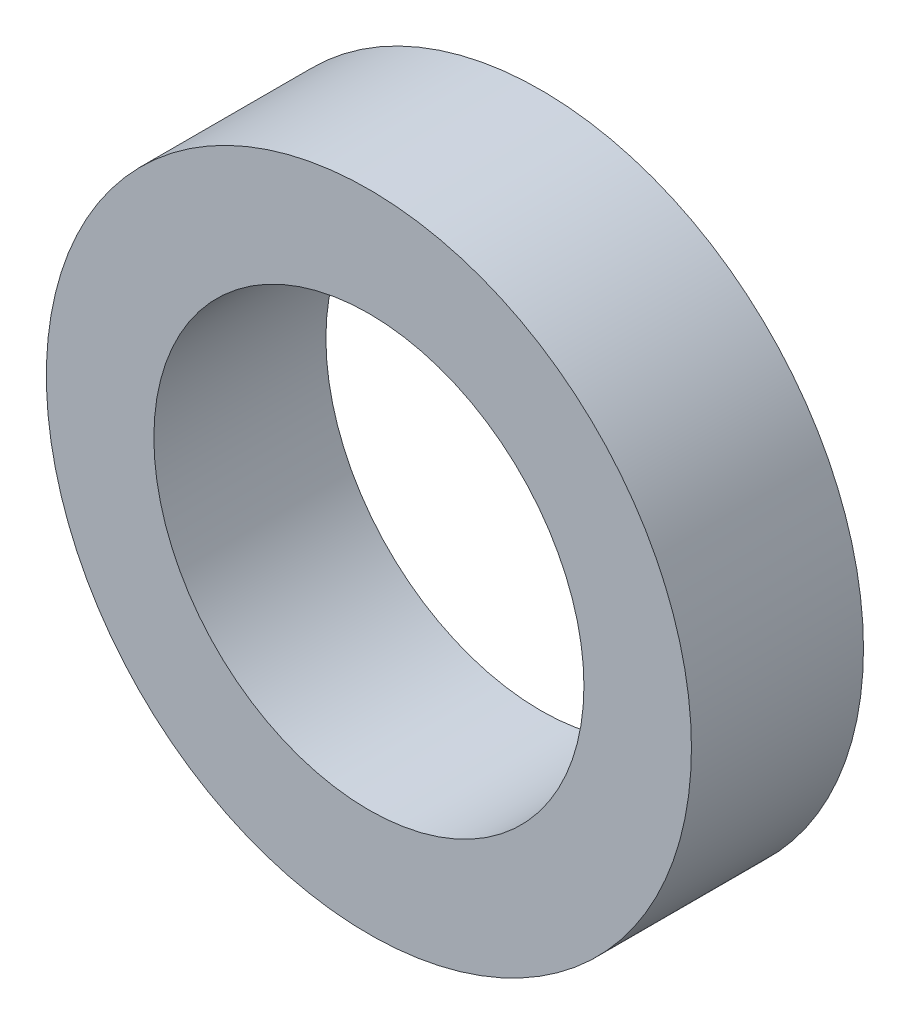
ISO-10303-21;
HEADER;
FILE_DESCRIPTION(('STEP AP214'),'2;1');
FILE_NAME('part.step','',(''),(''),'','','');
FILE_SCHEMA(('AUTOMOTIVE_DESIGN { 1 0 10303 214 1 1 1 1 }'));
ENDSEC;
DATA;
#1=APPLICATION_CONTEXT('core data for automotive mechanical design processes');
#2=APPLICATION_PROTOCOL_DEFINITION('international standard','automotive_design',2000,#1);
#3=PRODUCT_CONTEXT('',#1,'mechanical');
#4=PRODUCT('Part','Part','',(#3));
#5=PRODUCT_RELATED_PRODUCT_CATEGORY('part','',(#4));
#6=PRODUCT_DEFINITION_FORMATION('','',#4);
#7=PRODUCT_DEFINITION_CONTEXT('part definition',#1,'design');
#8=PRODUCT_DEFINITION('design','',#6,#7);
#9=PRODUCT_DEFINITION_SHAPE('','',#8);
#10=(LENGTH_UNIT() NAMED_UNIT(*) SI_UNIT(.MILLI.,.METRE.));
#11=(NAMED_UNIT(*) PLANE_ANGLE_UNIT() SI_UNIT($,.RADIAN.));
#12=(NAMED_UNIT(*) SI_UNIT($,.STERADIAN.) SOLID_ANGLE_UNIT());
#13=UNCERTAINTY_MEASURE_WITH_UNIT(LENGTH_MEASURE(1.E-05),#10,'distance_accuracy_value','');
#14=(GEOMETRIC_REPRESENTATION_CONTEXT(3) GLOBAL_UNCERTAINTY_ASSIGNED_CONTEXT((#13)) GLOBAL_UNIT_ASSIGNED_CONTEXT((#10,
#11,#12)) REPRESENTATION_CONTEXT('',''));
#15=CARTESIAN_POINT('',(0.,0.,0.));
#16=DIRECTION('',(0.,0.,1.));
#17=DIRECTION('',(1.,0.,0.));
#18=AXIS2_PLACEMENT_3D('',#15,#16,#17);
#19=CARTESIAN_POINT('',(0.,0.,2.));
#20=DIRECTION('',(0.,0.,1.));
#21=DIRECTION('',(1.,0.,0.));
#22=AXIS2_PLACEMENT_3D('',#19,#20,#21);
#23=PLANE('',#22);
#24=CARTESIAN_POINT('',(0.,0.,2.));
#25=DIRECTION('',(0.,0.,1.));
#26=DIRECTION('',(1.,0.,0.));
#27=AXIS2_PLACEMENT_3D('',#24,#25,#26);
#28=CIRCLE('',#27,7.5);
#29=CARTESIAN_POINT('',(7.5,0.,2.));
#30=VERTEX_POINT('',#29);
#31=EDGE_CURVE('E10',#30,#30,#28,.T.);
#32=ORIENTED_EDGE('',*,*,#31,.T.);
#33=EDGE_LOOP('',(#32));
#34=FACE_BOUND('',#33,.T.);
#35=CARTESIAN_POINT('',(0.,0.,2.));
#36=DIRECTION('',(0.,0.,1.));
#37=DIRECTION('',(1.,0.,0.));
#38=AXIS2_PLACEMENT_3D('',#35,#36,#37);
#39=CIRCLE('',#38,5.);
#40=CARTESIAN_POINT('',(5.,0.,2.));
#41=VERTEX_POINT('',#40);
#42=EDGE_CURVE('E46',#41,#41,#39,.T.);
#43=ORIENTED_EDGE('',*,*,#42,.F.);
#44=EDGE_LOOP('',(#43));
#45=FACE_BOUND('',#44,.T.);
#46=ADVANCED_FACE('F35',(#34,#45),#23,.T.);
#47=CARTESIAN_POINT('',(0.,0.,-2.));
#48=DIRECTION('',(0.,0.,1.));
#49=DIRECTION('',(1.,0.,0.));
#50=AXIS2_PLACEMENT_3D('',#47,#48,#49);
#51=PLANE('',#50);
#52=CARTESIAN_POINT('',(0.,0.,-2.));
#53=DIRECTION('',(0.,0.,1.));
#54=DIRECTION('',(1.,0.,0.));
#55=AXIS2_PLACEMENT_3D('',#52,#53,#54);
#56=CIRCLE('',#55,7.5);
#57=CARTESIAN_POINT('',(7.5,0.,-2.));
#58=VERTEX_POINT('',#57);
#59=EDGE_CURVE('E39',#58,#58,#56,.T.);
#60=ORIENTED_EDGE('',*,*,#59,.F.);
#61=EDGE_LOOP('',(#60));
#62=FACE_BOUND('',#61,.T.);
#63=CARTESIAN_POINT('',(0.,0.,-2.));
#64=DIRECTION('',(0.,0.,1.));
#65=DIRECTION('',(1.,0.,0.));
#66=AXIS2_PLACEMENT_3D('',#63,#64,#65);
#67=CIRCLE('',#66,5.);
#68=CARTESIAN_POINT('',(5.,0.,-2.));
#69=VERTEX_POINT('',#68);
#70=EDGE_CURVE('E48',#69,#69,#67,.T.);
#71=ORIENTED_EDGE('',*,*,#70,.T.);
#72=EDGE_LOOP('',(#71));
#73=FACE_BOUND('',#72,.T.);
#74=ADVANCED_FACE('F58',(#62,#73),#51,.F.);
#75=CARTESIAN_POINT('',(0.,0.,2.));
#76=DIRECTION('',(0.,0.,-1.));
#77=DIRECTION('',(-1.,0.,0.));
#78=AXIS2_PLACEMENT_3D('',#75,#76,#77);
#79=CYLINDRICAL_SURFACE('',#78,7.5);
#80=ORIENTED_EDGE('',*,*,#31,.F.);
#81=EDGE_LOOP('',(#80));
#82=FACE_BOUND('',#81,.T.);
#83=ORIENTED_EDGE('',*,*,#59,.T.);
#84=EDGE_LOOP('',(#83));
#85=FACE_BOUND('',#84,.T.);
#86=ADVANCED_FACE('F37',(#82,#85),#79,.T.);
#87=CARTESIAN_POINT('',(0.,0.,2.));
#88=DIRECTION('',(0.,0.,-1.));
#89=DIRECTION('',(-1.,0.,0.));
#90=AXIS2_PLACEMENT_3D('',#87,#88,#89);
#91=CYLINDRICAL_SURFACE('',#90,5.);
#92=ORIENTED_EDGE('',*,*,#42,.T.);
#93=EDGE_LOOP('',(#92));
#94=FACE_BOUND('',#93,.T.);
#95=ORIENTED_EDGE('',*,*,#70,.F.);
#96=EDGE_LOOP('',(#95));
#97=FACE_BOUND('',#96,.T.);
#98=ADVANCED_FACE('F54',(#94,#97),#91,.F.);
#99=CLOSED_SHELL('',(#46,#74,#86,#98));
#100=MANIFOLD_SOLID_BREP('B2',#99);
#101=ADVANCED_BREP_SHAPE_REPRESENTATION('',(#18,#100),#14);
#102=SHAPE_DEFINITION_REPRESENTATION(#9,#101);
ENDSEC;
END-ISO-10303-21;
